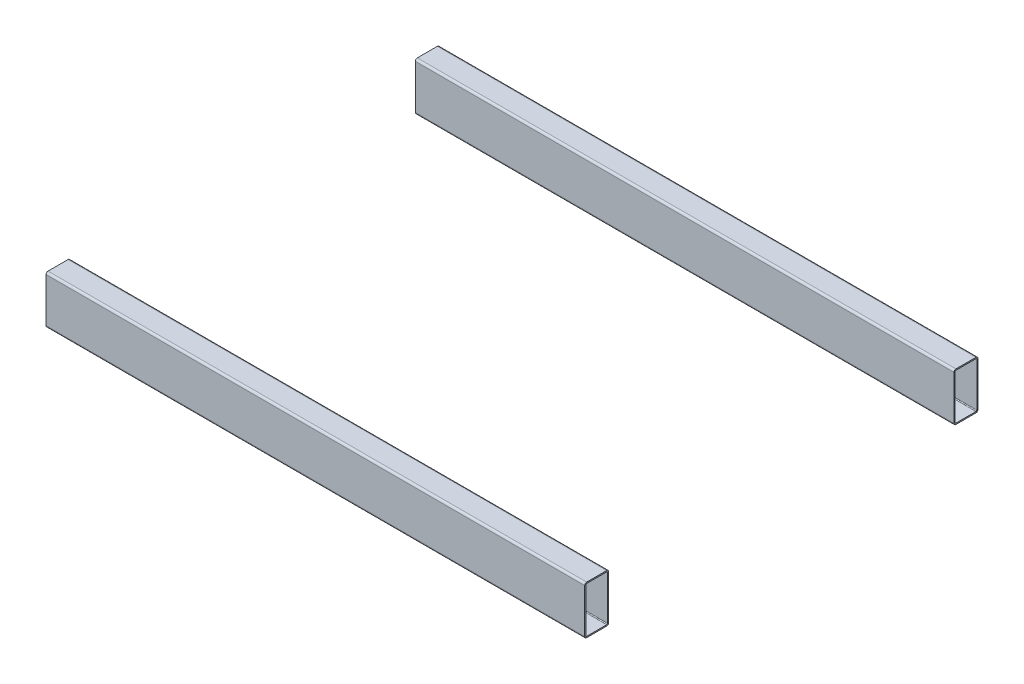
ISO-10303-21;
HEADER;
FILE_DESCRIPTION(('STEP AP214'),'2;1');
FILE_NAME('part.step','',(''),(''),'','','');
FILE_SCHEMA(('AUTOMOTIVE_DESIGN { 1 0 10303 214 1 1 1 1 }'));
ENDSEC;
DATA;
#1=APPLICATION_CONTEXT('core data for automotive mechanical design processes');
#2=APPLICATION_PROTOCOL_DEFINITION('international standard','automotive_design',2000,#1);
#3=PRODUCT_CONTEXT('',#1,'mechanical');
#4=PRODUCT('Part','Part','',(#3));
#5=PRODUCT_RELATED_PRODUCT_CATEGORY('part','',(#4));
#6=PRODUCT_DEFINITION_FORMATION('','',#4);
#7=PRODUCT_DEFINITION_CONTEXT('part definition',#1,'design');
#8=PRODUCT_DEFINITION('design','',#6,#7);
#9=PRODUCT_DEFINITION_SHAPE('','',#8);
#10=(LENGTH_UNIT() NAMED_UNIT(*) SI_UNIT(.MILLI.,.METRE.));
#11=(NAMED_UNIT(*) PLANE_ANGLE_UNIT() SI_UNIT($,.RADIAN.));
#12=(NAMED_UNIT(*) SI_UNIT($,.STERADIAN.) SOLID_ANGLE_UNIT());
#13=UNCERTAINTY_MEASURE_WITH_UNIT(LENGTH_MEASURE(1.E-05),#10,'distance_accuracy_value','');
#14=(GEOMETRIC_REPRESENTATION_CONTEXT(3) GLOBAL_UNCERTAINTY_ASSIGNED_CONTEXT((#13)) GLOBAL_UNIT_ASSIGNED_CONTEXT((#10,
#11,#12)) REPRESENTATION_CONTEXT('',''));
#15=CARTESIAN_POINT('',(0.,0.,0.));
#16=DIRECTION('',(0.,0.,1.));
#17=DIRECTION('',(1.,0.,0.));
#18=AXIS2_PLACEMENT_3D('',#15,#16,#17);
#19=CARTESIAN_POINT('',(-671.,-1294.,-919.999999999997));
#20=DIRECTION('',(0.,-1.,0.));
#21=DIRECTION('',(0.,0.,-1.));
#22=AXIS2_PLACEMENT_3D('',#19,#20,#21);
#23=PLANE('',#22);
#24=DIRECTION('',(0.,0.,1.));
#25=VECTOR('',#24,1.);
#26=CARTESIAN_POINT('',(-671.,-1294.,-919.999999999997));
#27=LINE('',#26,#25);
#28=CARTESIAN_POINT('',(-671.,-1294.,-914.999999999997));
#29=VERTEX_POINT('',#28);
#30=CARTESIAN_POINT('',(-671.,-1294.,-864.999999999997));
#31=VERTEX_POINT('',#30);
#32=EDGE_CURVE('E221',#29,#31,#27,.T.);
#33=ORIENTED_EDGE('',*,*,#32,.T.);
#34=DIRECTION('',(1.,0.,0.));
#35=VECTOR('',#34,1.);
#36=CARTESIAN_POINT('',(-671.,-1294.,-864.999999999997));
#37=LINE('',#36,#35);
#38=CARTESIAN_POINT('',(671.,-1294.,-864.999999999997));
#39=VERTEX_POINT('',#38);
#40=EDGE_CURVE('E270',#31,#39,#37,.T.);
#41=ORIENTED_EDGE('',*,*,#40,.T.);
#42=DIRECTION('',(0.,0.,1.));
#43=VECTOR('',#42,1.);
#44=CARTESIAN_POINT('',(671.,-1294.,-919.999999999997));
#45=LINE('',#44,#43);
#46=CARTESIAN_POINT('',(671.,-1294.,-914.999999999997));
#47=VERTEX_POINT('',#46);
#48=EDGE_CURVE('E234',#47,#39,#45,.T.);
#49=ORIENTED_EDGE('',*,*,#48,.F.);
#50=DIRECTION('',(1.,0.,0.));
#51=VECTOR('',#50,1.);
#52=CARTESIAN_POINT('',(-671.,-1294.,-914.999999999997));
#53=LINE('',#52,#51);
#54=EDGE_CURVE('E268',#47,#29,#53,.F.);
#55=ORIENTED_EDGE('',*,*,#54,.T.);
#56=EDGE_LOOP('',(#33,#41,#49,#55));
#57=FACE_BOUND('',#56,.T.);
#58=ADVANCED_FACE('F44',(#57),#23,.F.);
#59=CARTESIAN_POINT('',(671.,-1294.,-919.999999999997));
#60=DIRECTION('',(-1.,0.,0.));
#61=DIRECTION('',(0.,0.,1.));
#62=AXIS2_PLACEMENT_3D('',#59,#60,#61);
#63=PLANE('',#62);
#64=DIRECTION('',(0.,-1.,0.));
#65=VECTOR('',#64,1.);
#66=CARTESIAN_POINT('',(671.,-1299.,-916.999999999997));
#67=LINE('',#66,#65);
#68=CARTESIAN_POINT('',(671.,-1299.,-916.999999999997));
#69=VERTEX_POINT('',#68);
#70=CARTESIAN_POINT('',(671.,-1409.,-916.999999999997));
#71=VERTEX_POINT('',#70);
#72=EDGE_CURVE('E176',#69,#71,#67,.T.);
#73=ORIENTED_EDGE('',*,*,#72,.T.);
#74=CARTESIAN_POINT('',(671.,-1409.,-914.999999999997));
#75=DIRECTION('',(-1.,0.,0.));
#76=DIRECTION('',(0.,0.,1.));
#77=AXIS2_PLACEMENT_3D('',#74,#75,#76);
#78=CIRCLE('',#77,2.);
#79=CARTESIAN_POINT('',(671.,-1411.,-914.999999999997));
#80=VERTEX_POINT('',#79);
#81=EDGE_CURVE('E158',#71,#80,#78,.T.);
#82=ORIENTED_EDGE('',*,*,#81,.T.);
#83=DIRECTION('',(0.,0.,1.));
#84=VECTOR('',#83,1.);
#85=CARTESIAN_POINT('',(671.,-1411.,-914.999999999997));
#86=LINE('',#85,#84);
#87=CARTESIAN_POINT('',(671.,-1411.,-864.999999999997));
#88=VERTEX_POINT('',#87);
#89=EDGE_CURVE('E166',#80,#88,#86,.T.);
#90=ORIENTED_EDGE('',*,*,#89,.T.);
#91=CARTESIAN_POINT('',(671.,-1409.,-864.999999999997));
#92=DIRECTION('',(-1.,0.,0.));
#93=DIRECTION('',(0.,0.,1.));
#94=AXIS2_PLACEMENT_3D('',#91,#92,#93);
#95=CIRCLE('',#94,2.);
#96=CARTESIAN_POINT('',(671.,-1409.,-862.999999999997));
#97=VERTEX_POINT('',#96);
#98=EDGE_CURVE('E170',#88,#97,#95,.T.);
#99=ORIENTED_EDGE('',*,*,#98,.T.);
#100=DIRECTION('',(0.,1.,0.));
#101=VECTOR('',#100,1.);
#102=CARTESIAN_POINT('',(671.,-1409.,-862.999999999997));
#103=LINE('',#102,#101);
#104=CARTESIAN_POINT('',(671.,-1299.,-862.999999999997));
#105=VERTEX_POINT('',#104);
#106=EDGE_CURVE('E184',#97,#105,#103,.T.);
#107=ORIENTED_EDGE('',*,*,#106,.T.);
#108=CARTESIAN_POINT('',(671.,-1299.,-864.999999999997));
#109=DIRECTION('',(-1.,0.,0.));
#110=DIRECTION('',(0.,0.,1.));
#111=AXIS2_PLACEMENT_3D('',#108,#109,#110);
#112=CIRCLE('',#111,2.);
#113=CARTESIAN_POINT('',(671.,-1297.,-864.999999999997));
#114=VERTEX_POINT('',#113);
#115=EDGE_CURVE('E187',#105,#114,#112,.T.);
#116=ORIENTED_EDGE('',*,*,#115,.T.);
#117=DIRECTION('',(0.,0.,-1.));
#118=VECTOR('',#117,1.);
#119=CARTESIAN_POINT('',(671.,-1297.,-864.999999999997));
#120=LINE('',#119,#118);
#121=CARTESIAN_POINT('',(671.,-1297.,-914.999999999997));
#122=VERTEX_POINT('',#121);
#123=EDGE_CURVE('E190',#114,#122,#120,.T.);
#124=ORIENTED_EDGE('',*,*,#123,.T.);
#125=CARTESIAN_POINT('',(671.,-1299.,-914.999999999997));
#126=DIRECTION('',(-1.,0.,0.));
#127=DIRECTION('',(0.,0.,1.));
#128=AXIS2_PLACEMENT_3D('',#125,#126,#127);
#129=CIRCLE('',#128,2.);
#130=EDGE_CURVE('E193',#122,#69,#129,.T.);
#131=ORIENTED_EDGE('',*,*,#130,.T.);
#132=EDGE_LOOP('',(#73,#82,#90,#99,#107,#116,#124,#131));
#133=FACE_BOUND('',#132,.T.);
#134=DIRECTION('',(0.,-1.,0.));
#135=VECTOR('',#134,1.);
#136=CARTESIAN_POINT('',(671.,-1294.,-859.999999999997));
#137=LINE('',#136,#135);
#138=CARTESIAN_POINT('',(671.,-1299.,-859.999999999997));
#139=VERTEX_POINT('',#138);
#140=CARTESIAN_POINT('',(671.,-1409.,-859.999999999997));
#141=VERTEX_POINT('',#140);
#142=EDGE_CURVE('E196',#139,#141,#137,.T.);
#143=ORIENTED_EDGE('',*,*,#142,.T.);
#144=CARTESIAN_POINT('',(671.,-1409.,-864.999999999997));
#145=DIRECTION('',(-1.,0.,0.));
#146=DIRECTION('',(0.,0.,1.));
#147=AXIS2_PLACEMENT_3D('',#144,#145,#146);
#148=CIRCLE('',#147,5.);
#149=CARTESIAN_POINT('',(671.,-1414.,-864.999999999997));
#150=VERTEX_POINT('',#149);
#151=EDGE_CURVE('E260',#141,#150,#148,.F.);
#152=ORIENTED_EDGE('',*,*,#151,.T.);
#153=DIRECTION('',(0.,0.,1.));
#154=VECTOR('',#153,1.);
#155=CARTESIAN_POINT('',(671.,-1414.,-919.999999999997));
#156=LINE('',#155,#154);
#157=CARTESIAN_POINT('',(671.,-1414.,-914.999999999997));
#158=VERTEX_POINT('',#157);
#159=EDGE_CURVE('E231',#158,#150,#156,.T.);
#160=ORIENTED_EDGE('',*,*,#159,.F.);
#161=CARTESIAN_POINT('',(671.,-1409.,-914.999999999997));
#162=DIRECTION('',(-1.,0.,0.));
#163=DIRECTION('',(0.,0.,1.));
#164=AXIS2_PLACEMENT_3D('',#161,#162,#163);
#165=CIRCLE('',#164,5.);
#166=CARTESIAN_POINT('',(671.,-1409.,-919.999999999997));
#167=VERTEX_POINT('',#166);
#168=EDGE_CURVE('E258',#158,#167,#165,.F.);
#169=ORIENTED_EDGE('',*,*,#168,.T.);
#170=DIRECTION('',(0.,-1.,0.));
#171=VECTOR('',#170,1.);
#172=CARTESIAN_POINT('',(671.,-1294.,-919.999999999997));
#173=LINE('',#172,#171);
#174=CARTESIAN_POINT('',(671.,-1299.,-919.999999999997));
#175=VERTEX_POINT('',#174);
#176=EDGE_CURVE('E214',#175,#167,#173,.T.);
#177=ORIENTED_EDGE('',*,*,#176,.F.);
#178=CARTESIAN_POINT('',(671.,-1299.,-914.999999999997));
#179=DIRECTION('',(-1.,0.,0.));
#180=DIRECTION('',(0.,0.,1.));
#181=AXIS2_PLACEMENT_3D('',#178,#179,#180);
#182=CIRCLE('',#181,5.);
#183=EDGE_CURVE('E254',#175,#47,#182,.F.);
#184=ORIENTED_EDGE('',*,*,#183,.T.);
#185=ORIENTED_EDGE('',*,*,#48,.T.);
#186=CARTESIAN_POINT('',(671.,-1299.,-864.999999999997));
#187=DIRECTION('',(-1.,0.,0.));
#188=DIRECTION('',(0.,0.,1.));
#189=AXIS2_PLACEMENT_3D('',#186,#187,#188);
#190=CIRCLE('',#189,5.);
#191=EDGE_CURVE('E256',#39,#139,#190,.F.);
#192=ORIENTED_EDGE('',*,*,#191,.T.);
#193=EDGE_LOOP('',(#143,#152,#160,#169,#177,#184,#185,#192));
#194=FACE_BOUND('',#193,.T.);
#195=ADVANCED_FACE('F172',(#133,#194),#63,.F.);
#196=CARTESIAN_POINT('',(671.,-1414.,-919.999999999997));
#197=DIRECTION('',(0.,1.,0.));
#198=DIRECTION('',(0.,0.,1.));
#199=AXIS2_PLACEMENT_3D('',#196,#197,#198);
#200=PLANE('',#199);
#201=ORIENTED_EDGE('',*,*,#159,.T.);
#202=DIRECTION('',(-1.,0.,0.));
#203=VECTOR('',#202,1.);
#204=CARTESIAN_POINT('',(671.,-1414.,-864.999999999997));
#205=LINE('',#204,#203);
#206=CARTESIAN_POINT('',(-671.,-1414.,-864.999999999997));
#207=VERTEX_POINT('',#206);
#208=EDGE_CURVE('E239',#150,#207,#205,.T.);
#209=ORIENTED_EDGE('',*,*,#208,.T.);
#210=DIRECTION('',(0.,0.,1.));
#211=VECTOR('',#210,1.);
#212=CARTESIAN_POINT('',(-671.,-1414.,-919.999999999997));
#213=LINE('',#212,#211);
#214=CARTESIAN_POINT('',(-671.,-1414.,-914.999999999997));
#215=VERTEX_POINT('',#214);
#216=EDGE_CURVE('E228',#215,#207,#213,.T.);
#217=ORIENTED_EDGE('',*,*,#216,.F.);
#218=DIRECTION('',(-1.,0.,0.));
#219=VECTOR('',#218,1.);
#220=CARTESIAN_POINT('',(671.,-1414.,-914.999999999997));
#221=LINE('',#220,#219);
#222=EDGE_CURVE('E237',#215,#158,#221,.F.);
#223=ORIENTED_EDGE('',*,*,#222,.T.);
#224=EDGE_LOOP('',(#201,#209,#217,#223));
#225=FACE_BOUND('',#224,.T.);
#226=ADVANCED_FACE('F316',(#225),#200,.F.);
#227=CARTESIAN_POINT('',(-671.,-1414.,-919.999999999997));
#228=DIRECTION('',(1.,0.,0.));
#229=DIRECTION('',(0.,0.,-1.));
#230=AXIS2_PLACEMENT_3D('',#227,#228,#229);
#231=PLANE('',#230);
#232=DIRECTION('',(0.,0.,1.));
#233=VECTOR('',#232,1.);
#234=CARTESIAN_POINT('',(-671.,-1411.,-914.999999999997));
#235=LINE('',#234,#233);
#236=CARTESIAN_POINT('',(-671.,-1411.,-914.999999999997));
#237=VERTEX_POINT('',#236);
#238=CARTESIAN_POINT('',(-671.,-1411.,-864.999999999997));
#239=VERTEX_POINT('',#238);
#240=EDGE_CURVE('E198',#237,#239,#235,.T.);
#241=ORIENTED_EDGE('',*,*,#240,.F.);
#242=CARTESIAN_POINT('',(-671.,-1409.,-914.999999999997));
#243=DIRECTION('',(-1.,0.,0.));
#244=DIRECTION('',(0.,0.,1.));
#245=AXIS2_PLACEMENT_3D('',#242,#243,#244);
#246=CIRCLE('',#245,2.);
#247=CARTESIAN_POINT('',(-671.,-1409.,-916.999999999997));
#248=VERTEX_POINT('',#247);
#249=EDGE_CURVE('E161',#248,#237,#246,.T.);
#250=ORIENTED_EDGE('',*,*,#249,.F.);
#251=DIRECTION('',(0.,-1.,0.));
#252=VECTOR('',#251,1.);
#253=CARTESIAN_POINT('',(-671.,-1299.,-916.999999999997));
#254=LINE('',#253,#252);
#255=CARTESIAN_POINT('',(-671.,-1299.,-916.999999999997));
#256=VERTEX_POINT('',#255);
#257=EDGE_CURVE('E177',#256,#248,#254,.T.);
#258=ORIENTED_EDGE('',*,*,#257,.F.);
#259=CARTESIAN_POINT('',(-671.,-1299.,-914.999999999997));
#260=DIRECTION('',(-1.,0.,0.));
#261=DIRECTION('',(0.,0.,1.));
#262=AXIS2_PLACEMENT_3D('',#259,#260,#261);
#263=CIRCLE('',#262,2.);
#264=CARTESIAN_POINT('',(-671.,-1297.,-914.999999999997));
#265=VERTEX_POINT('',#264);
#266=EDGE_CURVE('E180',#265,#256,#263,.T.);
#267=ORIENTED_EDGE('',*,*,#266,.F.);
#268=DIRECTION('',(0.,0.,-1.));
#269=VECTOR('',#268,1.);
#270=CARTESIAN_POINT('',(-671.,-1297.,-864.999999999997));
#271=LINE('',#270,#269);
#272=CARTESIAN_POINT('',(-671.,-1297.,-864.999999999997));
#273=VERTEX_POINT('',#272);
#274=EDGE_CURVE('E209',#273,#265,#271,.T.);
#275=ORIENTED_EDGE('',*,*,#274,.F.);
#276=CARTESIAN_POINT('',(-671.,-1299.,-864.999999999997));
#277=DIRECTION('',(-1.,0.,0.));
#278=DIRECTION('',(0.,0.,1.));
#279=AXIS2_PLACEMENT_3D('',#276,#277,#278);
#280=CIRCLE('',#279,2.);
#281=CARTESIAN_POINT('',(-671.,-1299.,-862.999999999997));
#282=VERTEX_POINT('',#281);
#283=EDGE_CURVE('E206',#282,#273,#280,.T.);
#284=ORIENTED_EDGE('',*,*,#283,.F.);
#285=DIRECTION('',(0.,1.,0.));
#286=VECTOR('',#285,1.);
#287=CARTESIAN_POINT('',(-671.,-1409.,-862.999999999997));
#288=LINE('',#287,#286);
#289=CARTESIAN_POINT('',(-671.,-1409.,-862.999999999997));
#290=VERTEX_POINT('',#289);
#291=EDGE_CURVE('E203',#290,#282,#288,.T.);
#292=ORIENTED_EDGE('',*,*,#291,.F.);
#293=CARTESIAN_POINT('',(-671.,-1409.,-864.999999999997));
#294=DIRECTION('',(-1.,0.,0.));
#295=DIRECTION('',(0.,0.,1.));
#296=AXIS2_PLACEMENT_3D('',#293,#294,#295);
#297=CIRCLE('',#296,2.);
#298=EDGE_CURVE('E200',#239,#290,#297,.T.);
#299=ORIENTED_EDGE('',*,*,#298,.F.);
#300=EDGE_LOOP('',(#241,#250,#258,#267,#275,#284,#292,#299));
#301=FACE_BOUND('',#300,.T.);
#302=ORIENTED_EDGE('',*,*,#216,.T.);
#303=CARTESIAN_POINT('',(-671.,-1409.,-864.999999999997));
#304=DIRECTION('',(1.,0.,0.));
#305=DIRECTION('',(0.,0.,-1.));
#306=AXIS2_PLACEMENT_3D('',#303,#304,#305);
#307=CIRCLE('',#306,5.);
#308=CARTESIAN_POINT('',(-671.,-1409.,-859.999999999997));
#309=VERTEX_POINT('',#308);
#310=EDGE_CURVE('E248',#207,#309,#307,.F.);
#311=ORIENTED_EDGE('',*,*,#310,.T.);
#312=DIRECTION('',(0.,1.,0.));
#313=VECTOR('',#312,1.);
#314=CARTESIAN_POINT('',(-671.,-1414.,-859.999999999997));
#315=LINE('',#314,#313);
#316=CARTESIAN_POINT('',(-671.,-1299.,-859.999999999997));
#317=VERTEX_POINT('',#316);
#318=EDGE_CURVE('E218',#309,#317,#315,.T.);
#319=ORIENTED_EDGE('',*,*,#318,.T.);
#320=CARTESIAN_POINT('',(-671.,-1299.,-864.999999999997));
#321=DIRECTION('',(1.,0.,0.));
#322=DIRECTION('',(0.,0.,-1.));
#323=AXIS2_PLACEMENT_3D('',#320,#321,#322);
#324=CIRCLE('',#323,5.);
#325=EDGE_CURVE('E244',#317,#31,#324,.F.);
#326=ORIENTED_EDGE('',*,*,#325,.T.);
#327=ORIENTED_EDGE('',*,*,#32,.F.);
#328=CARTESIAN_POINT('',(-671.,-1299.,-914.999999999997));
#329=DIRECTION('',(1.,0.,0.));
#330=DIRECTION('',(0.,0.,-1.));
#331=AXIS2_PLACEMENT_3D('',#328,#329,#330);
#332=CIRCLE('',#331,5.);
#333=CARTESIAN_POINT('',(-671.,-1299.,-919.999999999997));
#334=VERTEX_POINT('',#333);
#335=EDGE_CURVE('E242',#29,#334,#332,.F.);
#336=ORIENTED_EDGE('',*,*,#335,.T.);
#337=DIRECTION('',(0.,1.,0.));
#338=VECTOR('',#337,1.);
#339=CARTESIAN_POINT('',(-671.,-1414.,-919.999999999997));
#340=LINE('',#339,#338);
#341=CARTESIAN_POINT('',(-671.,-1409.,-919.999999999997));
#342=VERTEX_POINT('',#341);
#343=EDGE_CURVE('E217',#342,#334,#340,.T.);
#344=ORIENTED_EDGE('',*,*,#343,.F.);
#345=CARTESIAN_POINT('',(-671.,-1409.,-914.999999999997));
#346=DIRECTION('',(1.,0.,0.));
#347=DIRECTION('',(0.,0.,-1.));
#348=AXIS2_PLACEMENT_3D('',#345,#346,#347);
#349=CIRCLE('',#348,5.);
#350=EDGE_CURVE('E246',#342,#215,#349,.F.);
#351=ORIENTED_EDGE('',*,*,#350,.T.);
#352=EDGE_LOOP('',(#302,#311,#319,#326,#327,#336,#344,#351));
#353=FACE_BOUND('',#352,.T.);
#354=ADVANCED_FACE('F294',(#301,#353),#231,.F.);
#355=CARTESIAN_POINT('',(0.,0.,-919.999999999997));
#356=DIRECTION('',(0.,0.,-1.));
#357=DIRECTION('',(-1.,0.,0.));
#358=AXIS2_PLACEMENT_3D('',#355,#356,#357);
#359=PLANE('',#358);
#360=ORIENTED_EDGE('',*,*,#176,.T.);
#361=DIRECTION('',(-1.,0.,0.));
#362=VECTOR('',#361,1.);
#363=CARTESIAN_POINT('',(-671.,-1409.,-919.999999999997));
#364=LINE('',#363,#362);
#365=EDGE_CURVE('E265',#167,#342,#364,.T.);
#366=ORIENTED_EDGE('',*,*,#365,.T.);
#367=ORIENTED_EDGE('',*,*,#343,.T.);
#368=DIRECTION('',(1.,0.,0.));
#369=VECTOR('',#368,1.);
#370=CARTESIAN_POINT('',(671.,-1299.,-919.999999999997));
#371=LINE('',#370,#369);
#372=EDGE_CURVE('E262',#334,#175,#371,.T.);
#373=ORIENTED_EDGE('',*,*,#372,.T.);
#374=EDGE_LOOP('',(#360,#366,#367,#373));
#375=FACE_BOUND('',#374,.T.);
#376=ADVANCED_FACE('F443',(#375),#359,.T.);
#377=CARTESIAN_POINT('',(0.,0.,-859.999999999997));
#378=DIRECTION('',(0.,0.,-1.));
#379=DIRECTION('',(-1.,0.,0.));
#380=AXIS2_PLACEMENT_3D('',#377,#378,#379);
#381=PLANE('',#380);
#382=ORIENTED_EDGE('',*,*,#318,.F.);
#383=DIRECTION('',(-1.,0.,0.));
#384=VECTOR('',#383,1.);
#385=CARTESIAN_POINT('',(0.,-1409.,-859.999999999997));
#386=LINE('',#385,#384);
#387=EDGE_CURVE('E252',#309,#141,#386,.F.);
#388=ORIENTED_EDGE('',*,*,#387,.T.);
#389=ORIENTED_EDGE('',*,*,#142,.F.);
#390=DIRECTION('',(1.,0.,0.));
#391=VECTOR('',#390,1.);
#392=CARTESIAN_POINT('',(0.,-1299.,-859.999999999997));
#393=LINE('',#392,#391);
#394=EDGE_CURVE('E250',#139,#317,#393,.F.);
#395=ORIENTED_EDGE('',*,*,#394,.T.);
#396=EDGE_LOOP('',(#382,#388,#389,#395));
#397=FACE_BOUND('',#396,.T.);
#398=ADVANCED_FACE('F324',(#397),#381,.F.);
#399=CARTESIAN_POINT('',(671.,-1409.,-864.999999999997));
#400=DIRECTION('',(-1.,0.,0.));
#401=DIRECTION('',(0.,0.,1.));
#402=AXIS2_PLACEMENT_3D('',#399,#400,#401);
#403=CYLINDRICAL_SURFACE('',#402,5.);
#404=ORIENTED_EDGE('',*,*,#151,.F.);
#405=ORIENTED_EDGE('',*,*,#387,.F.);
#406=ORIENTED_EDGE('',*,*,#310,.F.);
#407=ORIENTED_EDGE('',*,*,#208,.F.);
#408=EDGE_LOOP('',(#404,#405,#406,#407));
#409=FACE_BOUND('',#408,.T.);
#410=ADVANCED_FACE('F320',(#409),#403,.T.);
#411=CARTESIAN_POINT('',(0.,-1409.,-914.999999999997));
#412=DIRECTION('',(1.,0.,0.));
#413=DIRECTION('',(0.,0.,-1.));
#414=AXIS2_PLACEMENT_3D('',#411,#412,#413);
#415=CYLINDRICAL_SURFACE('',#414,5.);
#416=ORIENTED_EDGE('',*,*,#168,.F.);
#417=ORIENTED_EDGE('',*,*,#222,.F.);
#418=ORIENTED_EDGE('',*,*,#350,.F.);
#419=ORIENTED_EDGE('',*,*,#365,.F.);
#420=EDGE_LOOP('',(#416,#417,#418,#419));
#421=FACE_BOUND('',#420,.T.);
#422=ADVANCED_FACE('F323',(#421),#415,.T.);
#423=CARTESIAN_POINT('',(-671.,-1299.,-864.999999999997));
#424=DIRECTION('',(1.,0.,0.));
#425=DIRECTION('',(0.,0.,-1.));
#426=AXIS2_PLACEMENT_3D('',#423,#424,#425);
#427=CYLINDRICAL_SURFACE('',#426,5.);
#428=ORIENTED_EDGE('',*,*,#325,.F.);
#429=ORIENTED_EDGE('',*,*,#394,.F.);
#430=ORIENTED_EDGE('',*,*,#191,.F.);
#431=ORIENTED_EDGE('',*,*,#40,.F.);
#432=EDGE_LOOP('',(#428,#429,#430,#431));
#433=FACE_BOUND('',#432,.T.);
#434=ADVANCED_FACE('F328',(#433),#427,.T.);
#435=CARTESIAN_POINT('',(0.,-1299.,-914.999999999997));
#436=DIRECTION('',(-1.,0.,0.));
#437=DIRECTION('',(0.,0.,1.));
#438=AXIS2_PLACEMENT_3D('',#435,#436,#437);
#439=CYLINDRICAL_SURFACE('',#438,5.);
#440=ORIENTED_EDGE('',*,*,#335,.F.);
#441=ORIENTED_EDGE('',*,*,#54,.F.);
#442=ORIENTED_EDGE('',*,*,#183,.F.);
#443=ORIENTED_EDGE('',*,*,#372,.F.);
#444=EDGE_LOOP('',(#440,#441,#442,#443));
#445=FACE_BOUND('',#444,.T.);
#446=ADVANCED_FACE('F332',(#445),#439,.T.);
#447=CARTESIAN_POINT('',(-671.,-1297.,-919.999999999997));
#448=DIRECTION('',(0.,-1.,0.));
#449=DIRECTION('',(0.,0.,-1.));
#450=AXIS2_PLACEMENT_3D('',#447,#448,#449);
#451=PLANE('',#450);
#452=DIRECTION('',(1.,0.,0.));
#453=VECTOR('',#452,1.);
#454=CARTESIAN_POINT('',(-671.,-1297.,-864.999999999997));
#455=LINE('',#454,#453);
#456=EDGE_CURVE('E48',#273,#114,#455,.T.);
#457=ORIENTED_EDGE('',*,*,#456,.F.);
#458=ORIENTED_EDGE('',*,*,#274,.T.);
#459=DIRECTION('',(1.,0.,0.));
#460=VECTOR('',#459,1.);
#461=CARTESIAN_POINT('',(-671.,-1297.,-914.999999999997));
#462=LINE('',#461,#460);
#463=EDGE_CURVE('E277',#122,#265,#462,.F.);
#464=ORIENTED_EDGE('',*,*,#463,.F.);
#465=ORIENTED_EDGE('',*,*,#123,.F.);
#466=EDGE_LOOP('',(#457,#458,#464,#465));
#467=FACE_BOUND('',#466,.T.);
#468=ADVANCED_FACE('F287',(#467),#451,.T.);
#469=CARTESIAN_POINT('',(671.,-1411.,-919.999999999997));
#470=DIRECTION('',(0.,1.,0.));
#471=DIRECTION('',(0.,0.,1.));
#472=AXIS2_PLACEMENT_3D('',#469,#470,#471);
#473=PLANE('',#472);
#474=DIRECTION('',(1.,0.,0.));
#475=VECTOR('',#474,1.);
#476=CARTESIAN_POINT('',(671.,-1411.,-864.999999999997));
#477=LINE('',#476,#475);
#478=EDGE_CURVE('E61',#88,#239,#477,.F.);
#479=ORIENTED_EDGE('',*,*,#478,.F.);
#480=ORIENTED_EDGE('',*,*,#89,.F.);
#481=DIRECTION('',(1.,0.,0.));
#482=VECTOR('',#481,1.);
#483=CARTESIAN_POINT('',(671.,-1411.,-914.999999999997));
#484=LINE('',#483,#482);
#485=EDGE_CURVE('E66',#237,#80,#484,.T.);
#486=ORIENTED_EDGE('',*,*,#485,.F.);
#487=ORIENTED_EDGE('',*,*,#240,.T.);
#488=EDGE_LOOP('',(#479,#480,#486,#487));
#489=FACE_BOUND('',#488,.T.);
#490=ADVANCED_FACE('F167',(#489),#473,.T.);
#491=CARTESIAN_POINT('',(0.,0.,-916.999999999997));
#492=DIRECTION('',(0.,0.,-1.));
#493=DIRECTION('',(-1.,0.,0.));
#494=AXIS2_PLACEMENT_3D('',#491,#492,#493);
#495=PLANE('',#494);
#496=DIRECTION('',(-1.,0.,0.));
#497=VECTOR('',#496,1.);
#498=CARTESIAN_POINT('',(0.,-1409.,-916.999999999997));
#499=LINE('',#498,#497);
#500=EDGE_CURVE('E163',#71,#248,#499,.T.);
#501=ORIENTED_EDGE('',*,*,#500,.F.);
#502=ORIENTED_EDGE('',*,*,#72,.F.);
#503=DIRECTION('',(-1.,0.,0.));
#504=VECTOR('',#503,1.);
#505=CARTESIAN_POINT('',(0.,-1299.,-916.999999999997));
#506=LINE('',#505,#504);
#507=EDGE_CURVE('E274',#256,#69,#506,.F.);
#508=ORIENTED_EDGE('',*,*,#507,.F.);
#509=ORIENTED_EDGE('',*,*,#257,.T.);
#510=EDGE_LOOP('',(#501,#502,#508,#509));
#511=FACE_BOUND('',#510,.T.);
#512=ADVANCED_FACE('F299',(#511),#495,.F.);
#513=CARTESIAN_POINT('',(0.,0.,-862.999999999997));
#514=DIRECTION('',(0.,0.,-1.));
#515=DIRECTION('',(-1.,0.,0.));
#516=AXIS2_PLACEMENT_3D('',#513,#514,#515);
#517=PLANE('',#516);
#518=DIRECTION('',(-1.,0.,0.));
#519=VECTOR('',#518,1.);
#520=CARTESIAN_POINT('',(0.,-1409.,-862.999999999997));
#521=LINE('',#520,#519);
#522=EDGE_CURVE('E53',#290,#97,#521,.F.);
#523=ORIENTED_EDGE('',*,*,#522,.F.);
#524=ORIENTED_EDGE('',*,*,#291,.T.);
#525=DIRECTION('',(-1.,0.,0.));
#526=VECTOR('',#525,1.);
#527=CARTESIAN_POINT('',(0.,-1299.,-862.999999999997));
#528=LINE('',#527,#526);
#529=EDGE_CURVE('E12',#105,#282,#528,.T.);
#530=ORIENTED_EDGE('',*,*,#529,.F.);
#531=ORIENTED_EDGE('',*,*,#106,.F.);
#532=EDGE_LOOP('',(#523,#524,#530,#531));
#533=FACE_BOUND('',#532,.T.);
#534=ADVANCED_FACE('F290',(#533),#517,.T.);
#535=CARTESIAN_POINT('',(671.,-1409.,-864.999999999997));
#536=DIRECTION('',(-1.,0.,0.));
#537=DIRECTION('',(0.,0.,1.));
#538=AXIS2_PLACEMENT_3D('',#535,#536,#537);
#539=CYLINDRICAL_SURFACE('',#538,2.);
#540=ORIENTED_EDGE('',*,*,#522,.T.);
#541=ORIENTED_EDGE('',*,*,#98,.F.);
#542=ORIENTED_EDGE('',*,*,#478,.T.);
#543=ORIENTED_EDGE('',*,*,#298,.T.);
#544=EDGE_LOOP('',(#540,#541,#542,#543));
#545=FACE_BOUND('',#544,.T.);
#546=ADVANCED_FACE('F301',(#545),#539,.F.);
#547=CARTESIAN_POINT('',(0.,-1409.,-914.999999999997));
#548=DIRECTION('',(1.,0.,0.));
#549=DIRECTION('',(0.,0.,-1.));
#550=AXIS2_PLACEMENT_3D('',#547,#548,#549);
#551=CYLINDRICAL_SURFACE('',#550,2.);
#552=ORIENTED_EDGE('',*,*,#485,.T.);
#553=ORIENTED_EDGE('',*,*,#81,.F.);
#554=ORIENTED_EDGE('',*,*,#500,.T.);
#555=ORIENTED_EDGE('',*,*,#249,.T.);
#556=EDGE_LOOP('',(#552,#553,#554,#555));
#557=FACE_BOUND('',#556,.T.);
#558=ADVANCED_FACE('F156',(#557),#551,.F.);
#559=CARTESIAN_POINT('',(-671.,-1299.,-864.999999999997));
#560=DIRECTION('',(1.,0.,0.));
#561=DIRECTION('',(0.,0.,-1.));
#562=AXIS2_PLACEMENT_3D('',#559,#560,#561);
#563=CYLINDRICAL_SURFACE('',#562,2.);
#564=ORIENTED_EDGE('',*,*,#529,.T.);
#565=ORIENTED_EDGE('',*,*,#283,.T.);
#566=ORIENTED_EDGE('',*,*,#456,.T.);
#567=ORIENTED_EDGE('',*,*,#115,.F.);
#568=EDGE_LOOP('',(#564,#565,#566,#567));
#569=FACE_BOUND('',#568,.T.);
#570=ADVANCED_FACE('F283',(#569),#563,.F.);
#571=CARTESIAN_POINT('',(0.,-1299.,-914.999999999997));
#572=DIRECTION('',(-1.,0.,0.));
#573=DIRECTION('',(0.,0.,1.));
#574=AXIS2_PLACEMENT_3D('',#571,#572,#573);
#575=CYLINDRICAL_SURFACE('',#574,2.);
#576=ORIENTED_EDGE('',*,*,#463,.T.);
#577=ORIENTED_EDGE('',*,*,#266,.T.);
#578=ORIENTED_EDGE('',*,*,#507,.T.);
#579=ORIENTED_EDGE('',*,*,#130,.F.);
#580=EDGE_LOOP('',(#576,#577,#578,#579));
#581=FACE_BOUND('',#580,.T.);
#582=ADVANCED_FACE('F46',(#581),#575,.F.);
#583=CLOSED_SHELL('',(#58,#195,#226,#354,#376,#398,#410,#422,#434,#446,#468,#490,#512,#534,#546,
#558,#570,#582));
#584=MANIFOLD_SOLID_BREP('B2',#583);
#585=CARTESIAN_POINT('',(671.,-1294.,60.));
#586=DIRECTION('',(-1.,0.,0.));
#587=DIRECTION('',(0.,0.,1.));
#588=AXIS2_PLACEMENT_3D('',#585,#586,#587);
#589=PLANE('',#588);
#590=DIRECTION('',(0.,-1.,0.));
#591=VECTOR('',#590,1.);
#592=CARTESIAN_POINT('',(671.,-1299.,3.));
#593=LINE('',#592,#591);
#594=CARTESIAN_POINT('',(671.,-1299.,3.));
#595=VERTEX_POINT('',#594);
#596=CARTESIAN_POINT('',(671.,-1409.,3.));
#597=VERTEX_POINT('',#596);
#598=EDGE_CURVE('E636',#595,#597,#593,.T.);
#599=ORIENTED_EDGE('',*,*,#598,.T.);
#600=CARTESIAN_POINT('',(671.,-1409.,5.));
#601=DIRECTION('',(-1.,0.,0.));
#602=DIRECTION('',(0.,0.,1.));
#603=AXIS2_PLACEMENT_3D('',#600,#601,#602);
#604=CIRCLE('',#603,2.);
#605=CARTESIAN_POINT('',(671.,-1411.,5.));
#606=VERTEX_POINT('',#605);
#607=EDGE_CURVE('E619',#597,#606,#604,.T.);
#608=ORIENTED_EDGE('',*,*,#607,.T.);
#609=DIRECTION('',(0.,0.,1.));
#610=VECTOR('',#609,1.);
#611=CARTESIAN_POINT('',(671.,-1411.,5.));
#612=LINE('',#611,#610);
#613=CARTESIAN_POINT('',(671.,-1411.,55.));
#614=VERTEX_POINT('',#613);
#615=EDGE_CURVE('E627',#606,#614,#612,.T.);
#616=ORIENTED_EDGE('',*,*,#615,.T.);
#617=CARTESIAN_POINT('',(671.,-1409.,55.));
#618=DIRECTION('',(-1.,0.,0.));
#619=DIRECTION('',(0.,0.,1.));
#620=AXIS2_PLACEMENT_3D('',#617,#618,#619);
#621=CIRCLE('',#620,1.99999999999997);
#622=CARTESIAN_POINT('',(671.,-1409.,57.));
#623=VERTEX_POINT('',#622);
#624=EDGE_CURVE('E631',#614,#623,#621,.T.);
#625=ORIENTED_EDGE('',*,*,#624,.T.);
#626=DIRECTION('',(0.,1.,0.));
#627=VECTOR('',#626,1.);
#628=CARTESIAN_POINT('',(671.,-1409.,56.9999999999999));
#629=LINE('',#628,#627);
#630=CARTESIAN_POINT('',(671.,-1299.,57.));
#631=VERTEX_POINT('',#630);
#632=EDGE_CURVE('E644',#623,#631,#629,.T.);
#633=ORIENTED_EDGE('',*,*,#632,.T.);
#634=CARTESIAN_POINT('',(671.,-1299.,55.));
#635=DIRECTION('',(-1.,0.,0.));
#636=DIRECTION('',(0.,0.,1.));
#637=AXIS2_PLACEMENT_3D('',#634,#635,#636);
#638=CIRCLE('',#637,2.);
#639=CARTESIAN_POINT('',(671.,-1297.,55.));
#640=VERTEX_POINT('',#639);
#641=EDGE_CURVE('E647',#631,#640,#638,.T.);
#642=ORIENTED_EDGE('',*,*,#641,.T.);
#643=DIRECTION('',(0.,0.,-1.));
#644=VECTOR('',#643,1.);
#645=CARTESIAN_POINT('',(671.,-1297.,55.));
#646=LINE('',#645,#644);
#647=CARTESIAN_POINT('',(671.,-1297.,5.));
#648=VERTEX_POINT('',#647);
#649=EDGE_CURVE('E650',#640,#648,#646,.T.);
#650=ORIENTED_EDGE('',*,*,#649,.T.);
#651=CARTESIAN_POINT('',(671.,-1299.,5.));
#652=DIRECTION('',(-1.,0.,0.));
#653=DIRECTION('',(0.,0.,1.));
#654=AXIS2_PLACEMENT_3D('',#651,#652,#653);
#655=CIRCLE('',#654,2.);
#656=EDGE_CURVE('E653',#648,#595,#655,.T.);
#657=ORIENTED_EDGE('',*,*,#656,.T.);
#658=EDGE_LOOP('',(#599,#608,#616,#625,#633,#642,#650,#657));
#659=FACE_BOUND('',#658,.T.);
#660=DIRECTION('',(0.,0.,-1.));
#661=VECTOR('',#660,1.);
#662=CARTESIAN_POINT('',(671.,-1414.,60.));
#663=LINE('',#662,#661);
#664=CARTESIAN_POINT('',(671.,-1414.,55.));
#665=VERTEX_POINT('',#664);
#666=CARTESIAN_POINT('',(671.,-1414.,5.));
#667=VERTEX_POINT('',#666);
#668=EDGE_CURVE('E681',#665,#667,#663,.T.);
#669=ORIENTED_EDGE('',*,*,#668,.T.);
#670=CARTESIAN_POINT('',(671.,-1409.,5.));
#671=DIRECTION('',(-1.,0.,0.));
#672=DIRECTION('',(0.,0.,1.));
#673=AXIS2_PLACEMENT_3D('',#670,#671,#672);
#674=CIRCLE('',#673,5.);
#675=CARTESIAN_POINT('',(671.,-1409.,0.));
#676=VERTEX_POINT('',#675);
#677=EDGE_CURVE('E708',#667,#676,#674,.F.);
#678=ORIENTED_EDGE('',*,*,#677,.T.);
#679=DIRECTION('',(0.,1.,0.));
#680=VECTOR('',#679,1.);
#681=CARTESIAN_POINT('',(671.,-1294.,0.));
#682=LINE('',#681,#680);
#683=CARTESIAN_POINT('',(671.,-1299.,0.));
#684=VERTEX_POINT('',#683);
#685=EDGE_CURVE('E656',#676,#684,#682,.T.);
#686=ORIENTED_EDGE('',*,*,#685,.T.);
#687=CARTESIAN_POINT('',(671.,-1299.,5.));
#688=DIRECTION('',(-1.,0.,0.));
#689=DIRECTION('',(0.,0.,1.));
#690=AXIS2_PLACEMENT_3D('',#687,#688,#689);
#691=CIRCLE('',#690,5.);
#692=CARTESIAN_POINT('',(671.,-1294.,5.));
#693=VERTEX_POINT('',#692);
#694=EDGE_CURVE('E706',#684,#693,#691,.F.);
#695=ORIENTED_EDGE('',*,*,#694,.T.);
#696=DIRECTION('',(0.,0.,-1.));
#697=VECTOR('',#696,1.);
#698=CARTESIAN_POINT('',(671.,-1294.,60.));
#699=LINE('',#698,#697);
#700=CARTESIAN_POINT('',(671.,-1294.,55.));
#701=VERTEX_POINT('',#700);
#702=EDGE_CURVE('E694',#701,#693,#699,.T.);
#703=ORIENTED_EDGE('',*,*,#702,.F.);
#704=CARTESIAN_POINT('',(671.,-1299.,55.));
#705=DIRECTION('',(-1.,0.,0.));
#706=DIRECTION('',(0.,0.,1.));
#707=AXIS2_PLACEMENT_3D('',#704,#705,#706);
#708=CIRCLE('',#707,5.);
#709=CARTESIAN_POINT('',(671.,-1299.,60.));
#710=VERTEX_POINT('',#709);
#711=EDGE_CURVE('E704',#701,#710,#708,.F.);
#712=ORIENTED_EDGE('',*,*,#711,.T.);
#713=DIRECTION('',(0.,1.,0.));
#714=VECTOR('',#713,1.);
#715=CARTESIAN_POINT('',(671.,-1294.,60.));
#716=LINE('',#715,#714);
#717=CARTESIAN_POINT('',(671.,-1409.,60.));
#718=VERTEX_POINT('',#717);
#719=EDGE_CURVE('E674',#718,#710,#716,.T.);
#720=ORIENTED_EDGE('',*,*,#719,.F.);
#721=CARTESIAN_POINT('',(671.,-1409.,55.));
#722=DIRECTION('',(-1.,0.,0.));
#723=DIRECTION('',(0.,0.,1.));
#724=AXIS2_PLACEMENT_3D('',#721,#722,#723);
#725=CIRCLE('',#724,5.);
#726=EDGE_CURVE('E702',#718,#665,#725,.F.);
#727=ORIENTED_EDGE('',*,*,#726,.T.);
#728=EDGE_LOOP('',(#669,#678,#686,#695,#703,#712,#720,#727));
#729=FACE_BOUND('',#728,.T.);
#730=ADVANCED_FACE('F505',(#659,#729),#589,.F.);
#731=CARTESIAN_POINT('',(-671.,-1294.,60.));
#732=DIRECTION('',(0.,-1.,0.));
#733=DIRECTION('',(0.,0.,-1.));
#734=AXIS2_PLACEMENT_3D('',#731,#732,#733);
#735=PLANE('',#734);
#736=ORIENTED_EDGE('',*,*,#702,.T.);
#737=DIRECTION('',(-1.,0.,0.));
#738=VECTOR('',#737,1.);
#739=CARTESIAN_POINT('',(-671.,-1294.,5.));
#740=LINE('',#739,#738);
#741=CARTESIAN_POINT('',(-671.,-1294.,5.));
#742=VERTEX_POINT('',#741);
#743=EDGE_CURVE('E724',#693,#742,#740,.T.);
#744=ORIENTED_EDGE('',*,*,#743,.T.);
#745=DIRECTION('',(0.,0.,-1.));
#746=VECTOR('',#745,1.);
#747=CARTESIAN_POINT('',(-671.,-1294.,60.));
#748=LINE('',#747,#746);
#749=CARTESIAN_POINT('',(-671.,-1294.,55.));
#750=VERTEX_POINT('',#749);
#751=EDGE_CURVE('E691',#750,#742,#748,.T.);
#752=ORIENTED_EDGE('',*,*,#751,.F.);
#753=DIRECTION('',(-1.,0.,0.));
#754=VECTOR('',#753,1.);
#755=CARTESIAN_POINT('',(671.,-1294.,55.));
#756=LINE('',#755,#754);
#757=EDGE_CURVE('E722',#750,#701,#756,.F.);
#758=ORIENTED_EDGE('',*,*,#757,.T.);
#759=EDGE_LOOP('',(#736,#744,#752,#758));
#760=FACE_BOUND('',#759,.T.);
#761=ADVANCED_FACE('F767',(#760),#735,.F.);
#762=CARTESIAN_POINT('',(-671.,-1294.,60.));
#763=DIRECTION('',(1.,0.,0.));
#764=DIRECTION('',(0.,0.,-1.));
#765=AXIS2_PLACEMENT_3D('',#762,#763,#764);
#766=PLANE('',#765);
#767=DIRECTION('',(0.,0.,1.));
#768=VECTOR('',#767,1.);
#769=CARTESIAN_POINT('',(-671.,-1411.,5.));
#770=LINE('',#769,#768);
#771=CARTESIAN_POINT('',(-671.,-1411.,5.));
#772=VERTEX_POINT('',#771);
#773=CARTESIAN_POINT('',(-671.,-1411.,55.));
#774=VERTEX_POINT('',#773);
#775=EDGE_CURVE('E658',#772,#774,#770,.T.);
#776=ORIENTED_EDGE('',*,*,#775,.F.);
#777=CARTESIAN_POINT('',(-671.,-1409.,5.));
#778=DIRECTION('',(-1.,0.,0.));
#779=DIRECTION('',(0.,0.,1.));
#780=AXIS2_PLACEMENT_3D('',#777,#778,#779);
#781=CIRCLE('',#780,2.);
#782=CARTESIAN_POINT('',(-671.,-1409.,3.));
#783=VERTEX_POINT('',#782);
#784=EDGE_CURVE('E622',#783,#772,#781,.T.);
#785=ORIENTED_EDGE('',*,*,#784,.F.);
#786=DIRECTION('',(0.,-1.,0.));
#787=VECTOR('',#786,1.);
#788=CARTESIAN_POINT('',(-671.,-1299.,3.));
#789=LINE('',#788,#787);
#790=CARTESIAN_POINT('',(-671.,-1299.,3.));
#791=VERTEX_POINT('',#790);
#792=EDGE_CURVE('E637',#791,#783,#789,.T.);
#793=ORIENTED_EDGE('',*,*,#792,.F.);
#794=CARTESIAN_POINT('',(-671.,-1299.,5.));
#795=DIRECTION('',(-1.,0.,0.));
#796=DIRECTION('',(0.,0.,1.));
#797=AXIS2_PLACEMENT_3D('',#794,#795,#796);
#798=CIRCLE('',#797,2.);
#799=CARTESIAN_POINT('',(-671.,-1297.,5.));
#800=VERTEX_POINT('',#799);
#801=EDGE_CURVE('E640',#800,#791,#798,.T.);
#802=ORIENTED_EDGE('',*,*,#801,.F.);
#803=DIRECTION('',(0.,0.,-1.));
#804=VECTOR('',#803,1.);
#805=CARTESIAN_POINT('',(-671.,-1297.,55.));
#806=LINE('',#805,#804);
#807=CARTESIAN_POINT('',(-671.,-1297.,55.));
#808=VERTEX_POINT('',#807);
#809=EDGE_CURVE('E669',#808,#800,#806,.T.);
#810=ORIENTED_EDGE('',*,*,#809,.F.);
#811=CARTESIAN_POINT('',(-671.,-1299.,55.));
#812=DIRECTION('',(-1.,0.,0.));
#813=DIRECTION('',(0.,0.,1.));
#814=AXIS2_PLACEMENT_3D('',#811,#812,#813);
#815=CIRCLE('',#814,2.);
#816=CARTESIAN_POINT('',(-671.,-1299.,57.));
#817=VERTEX_POINT('',#816);
#818=EDGE_CURVE('E666',#817,#808,#815,.T.);
#819=ORIENTED_EDGE('',*,*,#818,.F.);
#820=DIRECTION('',(0.,1.,0.));
#821=VECTOR('',#820,1.);
#822=CARTESIAN_POINT('',(-671.,-1409.,56.9999999999999));
#823=LINE('',#822,#821);
#824=CARTESIAN_POINT('',(-671.,-1409.,57.));
#825=VERTEX_POINT('',#824);
#826=EDGE_CURVE('E663',#825,#817,#823,.T.);
#827=ORIENTED_EDGE('',*,*,#826,.F.);
#828=CARTESIAN_POINT('',(-671.,-1409.,55.));
#829=DIRECTION('',(-1.,0.,0.));
#830=DIRECTION('',(0.,0.,1.));
#831=AXIS2_PLACEMENT_3D('',#828,#829,#830);
#832=CIRCLE('',#831,1.99999999999997);
#833=EDGE_CURVE('E660',#774,#825,#832,.T.);
#834=ORIENTED_EDGE('',*,*,#833,.F.);
#835=EDGE_LOOP('',(#776,#785,#793,#802,#810,#819,#827,#834));
#836=FACE_BOUND('',#835,.T.);
#837=DIRECTION('',(0.,-1.,0.));
#838=VECTOR('',#837,1.);
#839=CARTESIAN_POINT('',(-671.,-1294.,0.));
#840=LINE('',#839,#838);
#841=CARTESIAN_POINT('',(-671.,-1299.,0.));
#842=VERTEX_POINT('',#841);
#843=CARTESIAN_POINT('',(-671.,-1409.,0.));
#844=VERTEX_POINT('',#843);
#845=EDGE_CURVE('E678',#842,#844,#840,.T.);
#846=ORIENTED_EDGE('',*,*,#845,.T.);
#847=CARTESIAN_POINT('',(-671.,-1409.,5.));
#848=DIRECTION('',(1.,0.,0.));
#849=DIRECTION('',(0.,0.,-1.));
#850=AXIS2_PLACEMENT_3D('',#847,#848,#849);
#851=CIRCLE('',#850,5.);
#852=CARTESIAN_POINT('',(-671.,-1414.,5.));
#853=VERTEX_POINT('',#852);
#854=EDGE_CURVE('E720',#844,#853,#851,.F.);
#855=ORIENTED_EDGE('',*,*,#854,.T.);
#856=DIRECTION('',(0.,0.,-1.));
#857=VECTOR('',#856,1.);
#858=CARTESIAN_POINT('',(-671.,-1414.,60.));
#859=LINE('',#858,#857);
#860=CARTESIAN_POINT('',(-671.,-1414.,55.));
#861=VERTEX_POINT('',#860);
#862=EDGE_CURVE('E688',#861,#853,#859,.T.);
#863=ORIENTED_EDGE('',*,*,#862,.F.);
#864=CARTESIAN_POINT('',(-671.,-1409.,55.));
#865=DIRECTION('',(1.,0.,0.));
#866=DIRECTION('',(0.,0.,-1.));
#867=AXIS2_PLACEMENT_3D('',#864,#865,#866);
#868=CIRCLE('',#867,5.);
#869=CARTESIAN_POINT('',(-671.,-1409.,60.));
#870=VERTEX_POINT('',#869);
#871=EDGE_CURVE('E714',#861,#870,#868,.F.);
#872=ORIENTED_EDGE('',*,*,#871,.T.);
#873=DIRECTION('',(0.,-1.,0.));
#874=VECTOR('',#873,1.);
#875=CARTESIAN_POINT('',(-671.,-1294.,60.));
#876=LINE('',#875,#874);
#877=CARTESIAN_POINT('',(-671.,-1299.,60.));
#878=VERTEX_POINT('',#877);
#879=EDGE_CURVE('E677',#878,#870,#876,.T.);
#880=ORIENTED_EDGE('',*,*,#879,.F.);
#881=CARTESIAN_POINT('',(-671.,-1299.,55.));
#882=DIRECTION('',(1.,0.,0.));
#883=DIRECTION('',(0.,0.,-1.));
#884=AXIS2_PLACEMENT_3D('',#881,#882,#883);
#885=CIRCLE('',#884,5.);
#886=EDGE_CURVE('E716',#878,#750,#885,.F.);
#887=ORIENTED_EDGE('',*,*,#886,.T.);
#888=ORIENTED_EDGE('',*,*,#751,.T.);
#889=CARTESIAN_POINT('',(-671.,-1299.,5.));
#890=DIRECTION('',(1.,0.,0.));
#891=DIRECTION('',(0.,0.,-1.));
#892=AXIS2_PLACEMENT_3D('',#889,#890,#891);
#893=CIRCLE('',#892,5.);
#894=EDGE_CURVE('E718',#742,#842,#893,.F.);
#895=ORIENTED_EDGE('',*,*,#894,.T.);
#896=EDGE_LOOP('',(#846,#855,#863,#872,#880,#887,#888,#895));
#897=FACE_BOUND('',#896,.T.);
#898=ADVANCED_FACE('F751',(#836,#897),#766,.F.);
#899=CARTESIAN_POINT('',(-671.,-1414.,60.));
#900=DIRECTION('',(0.,1.,0.));
#901=DIRECTION('',(0.,0.,1.));
#902=AXIS2_PLACEMENT_3D('',#899,#900,#901);
#903=PLANE('',#902);
#904=ORIENTED_EDGE('',*,*,#862,.T.);
#905=DIRECTION('',(1.,0.,0.));
#906=VECTOR('',#905,1.);
#907=CARTESIAN_POINT('',(-671.,-1414.,5.));
#908=LINE('',#907,#906);
#909=EDGE_CURVE('E699',#853,#667,#908,.T.);
#910=ORIENTED_EDGE('',*,*,#909,.T.);
#911=ORIENTED_EDGE('',*,*,#668,.F.);
#912=DIRECTION('',(1.,0.,0.));
#913=VECTOR('',#912,1.);
#914=CARTESIAN_POINT('',(-671.,-1414.,55.));
#915=LINE('',#914,#913);
#916=EDGE_CURVE('E697',#665,#861,#915,.F.);
#917=ORIENTED_EDGE('',*,*,#916,.T.);
#918=EDGE_LOOP('',(#904,#910,#911,#917));
#919=FACE_BOUND('',#918,.T.);
#920=ADVANCED_FACE('F902',(#919),#903,.F.);
#921=CARTESIAN_POINT('',(0.,0.,60.));
#922=DIRECTION('',(0.,0.,1.));
#923=DIRECTION('',(1.,0.,0.));
#924=AXIS2_PLACEMENT_3D('',#921,#922,#923);
#925=PLANE('',#924);
#926=ORIENTED_EDGE('',*,*,#719,.T.);
#927=DIRECTION('',(-1.,0.,0.));
#928=VECTOR('',#927,1.);
#929=CARTESIAN_POINT('',(-671.,-1299.,60.));
#930=LINE('',#929,#928);
#931=EDGE_CURVE('E730',#710,#878,#930,.T.);
#932=ORIENTED_EDGE('',*,*,#931,.T.);
#933=ORIENTED_EDGE('',*,*,#879,.T.);
#934=DIRECTION('',(1.,0.,0.));
#935=VECTOR('',#934,1.);
#936=CARTESIAN_POINT('',(671.,-1409.,60.));
#937=LINE('',#936,#935);
#938=EDGE_CURVE('E727',#870,#718,#937,.T.);
#939=ORIENTED_EDGE('',*,*,#938,.T.);
#940=EDGE_LOOP('',(#926,#932,#933,#939));
#941=FACE_BOUND('',#940,.T.);
#942=ADVANCED_FACE('F894',(#941),#925,.T.);
#943=CARTESIAN_POINT('',(0.,0.,0.));
#944=DIRECTION('',(0.,0.,1.));
#945=DIRECTION('',(1.,0.,0.));
#946=AXIS2_PLACEMENT_3D('',#943,#944,#945);
#947=PLANE('',#946);
#948=ORIENTED_EDGE('',*,*,#685,.F.);
#949=DIRECTION('',(1.,0.,0.));
#950=VECTOR('',#949,1.);
#951=CARTESIAN_POINT('',(0.,-1409.,0.));
#952=LINE('',#951,#950);
#953=EDGE_CURVE('E712',#676,#844,#952,.F.);
#954=ORIENTED_EDGE('',*,*,#953,.T.);
#955=ORIENTED_EDGE('',*,*,#845,.F.);
#956=DIRECTION('',(-1.,0.,0.));
#957=VECTOR('',#956,1.);
#958=CARTESIAN_POINT('',(0.,-1299.,0.));
#959=LINE('',#958,#957);
#960=EDGE_CURVE('E710',#842,#684,#959,.F.);
#961=ORIENTED_EDGE('',*,*,#960,.T.);
#962=EDGE_LOOP('',(#948,#954,#955,#961));
#963=FACE_BOUND('',#962,.T.);
#964=ADVANCED_FACE('F780',(#963),#947,.F.);
#965=CARTESIAN_POINT('',(-671.,-1409.,5.));
#966=DIRECTION('',(1.,0.,0.));
#967=DIRECTION('',(0.,0.,-1.));
#968=AXIS2_PLACEMENT_3D('',#965,#966,#967);
#969=CYLINDRICAL_SURFACE('',#968,5.);
#970=ORIENTED_EDGE('',*,*,#854,.F.);
#971=ORIENTED_EDGE('',*,*,#953,.F.);
#972=ORIENTED_EDGE('',*,*,#677,.F.);
#973=ORIENTED_EDGE('',*,*,#909,.F.);
#974=EDGE_LOOP('',(#970,#971,#972,#973));
#975=FACE_BOUND('',#974,.T.);
#976=ADVANCED_FACE('F776',(#975),#969,.T.);
#977=CARTESIAN_POINT('',(-671.,-1299.,5.));
#978=DIRECTION('',(-1.,0.,0.));
#979=DIRECTION('',(0.,0.,1.));
#980=AXIS2_PLACEMENT_3D('',#977,#978,#979);
#981=CYLINDRICAL_SURFACE('',#980,5.);
#982=ORIENTED_EDGE('',*,*,#694,.F.);
#983=ORIENTED_EDGE('',*,*,#960,.F.);
#984=ORIENTED_EDGE('',*,*,#894,.F.);
#985=ORIENTED_EDGE('',*,*,#743,.F.);
#986=EDGE_LOOP('',(#982,#983,#984,#985));
#987=FACE_BOUND('',#986,.T.);
#988=ADVANCED_FACE('F779',(#987),#981,.T.);
#989=CARTESIAN_POINT('',(0.,-1299.,55.));
#990=DIRECTION('',(1.,0.,0.));
#991=DIRECTION('',(0.,0.,-1.));
#992=AXIS2_PLACEMENT_3D('',#989,#990,#991);
#993=CYLINDRICAL_SURFACE('',#992,5.);
#994=ORIENTED_EDGE('',*,*,#711,.F.);
#995=ORIENTED_EDGE('',*,*,#757,.F.);
#996=ORIENTED_EDGE('',*,*,#886,.F.);
#997=ORIENTED_EDGE('',*,*,#931,.F.);
#998=EDGE_LOOP('',(#994,#995,#996,#997));
#999=FACE_BOUND('',#998,.T.);
#1000=ADVANCED_FACE('F784',(#999),#993,.T.);
#1001=CARTESIAN_POINT('',(0.,-1409.,55.));
#1002=DIRECTION('',(-1.,0.,0.));
#1003=DIRECTION('',(0.,0.,1.));
#1004=AXIS2_PLACEMENT_3D('',#1001,#1002,#1003);
#1005=CYLINDRICAL_SURFACE('',#1004,5.);
#1006=ORIENTED_EDGE('',*,*,#871,.F.);
#1007=ORIENTED_EDGE('',*,*,#916,.F.);
#1008=ORIENTED_EDGE('',*,*,#726,.F.);
#1009=ORIENTED_EDGE('',*,*,#938,.F.);
#1010=EDGE_LOOP('',(#1006,#1007,#1008,#1009));
#1011=FACE_BOUND('',#1010,.T.);
#1012=ADVANCED_FACE('F788',(#1011),#1005,.T.);
#1013=CARTESIAN_POINT('',(-671.,-1297.,60.));
#1014=DIRECTION('',(0.,-1.,0.));
#1015=DIRECTION('',(0.,0.,-1.));
#1016=AXIS2_PLACEMENT_3D('',#1013,#1014,#1015);
#1017=PLANE('',#1016);
#1018=DIRECTION('',(1.,0.,0.));
#1019=VECTOR('',#1018,1.);
#1020=CARTESIAN_POINT('',(-671.,-1297.,5.));
#1021=LINE('',#1020,#1019);
#1022=EDGE_CURVE('E509',#648,#800,#1021,.F.);
#1023=ORIENTED_EDGE('',*,*,#1022,.F.);
#1024=ORIENTED_EDGE('',*,*,#649,.F.);
#1025=DIRECTION('',(1.,0.,0.));
#1026=VECTOR('',#1025,1.);
#1027=CARTESIAN_POINT('',(-671.,-1297.,55.));
#1028=LINE('',#1027,#1026);
#1029=EDGE_CURVE('E624',#808,#640,#1028,.T.);
#1030=ORIENTED_EDGE('',*,*,#1029,.F.);
#1031=ORIENTED_EDGE('',*,*,#809,.T.);
#1032=EDGE_LOOP('',(#1023,#1024,#1030,#1031));
#1033=FACE_BOUND('',#1032,.T.);
#1034=ADVANCED_FACE('F748',(#1033),#1017,.T.);
#1035=CARTESIAN_POINT('',(-671.,-1411.,60.));
#1036=DIRECTION('',(0.,1.,0.));
#1037=DIRECTION('',(0.,0.,1.));
#1038=AXIS2_PLACEMENT_3D('',#1035,#1036,#1037);
#1039=PLANE('',#1038);
#1040=DIRECTION('',(1.,0.,0.));
#1041=VECTOR('',#1040,1.);
#1042=CARTESIAN_POINT('',(-671.,-1411.,5.));
#1043=LINE('',#1042,#1041);
#1044=EDGE_CURVE('E527',#772,#606,#1043,.T.);
#1045=ORIENTED_EDGE('',*,*,#1044,.F.);
#1046=ORIENTED_EDGE('',*,*,#775,.T.);
#1047=DIRECTION('',(1.,0.,0.));
#1048=VECTOR('',#1047,1.);
#1049=CARTESIAN_POINT('',(-671.,-1411.,55.));
#1050=LINE('',#1049,#1048);
#1051=EDGE_CURVE('E522',#614,#774,#1050,.F.);
#1052=ORIENTED_EDGE('',*,*,#1051,.F.);
#1053=ORIENTED_EDGE('',*,*,#615,.F.);
#1054=EDGE_LOOP('',(#1045,#1046,#1052,#1053));
#1055=FACE_BOUND('',#1054,.T.);
#1056=ADVANCED_FACE('F628',(#1055),#1039,.T.);
#1057=CARTESIAN_POINT('',(0.,0.,57.));
#1058=DIRECTION('',(0.,0.,1.));
#1059=DIRECTION('',(1.,0.,0.));
#1060=AXIS2_PLACEMENT_3D('',#1057,#1058,#1059);
#1061=PLANE('',#1060);
#1062=DIRECTION('',(1.,0.,0.));
#1063=VECTOR('',#1062,1.);
#1064=CARTESIAN_POINT('',(0.,-1299.,57.));
#1065=LINE('',#1064,#1063);
#1066=EDGE_CURVE('E736',#631,#817,#1065,.F.);
#1067=ORIENTED_EDGE('',*,*,#1066,.F.);
#1068=ORIENTED_EDGE('',*,*,#632,.F.);
#1069=DIRECTION('',(1.,0.,0.));
#1070=VECTOR('',#1069,1.);
#1071=CARTESIAN_POINT('',(0.,-1409.,57.));
#1072=LINE('',#1071,#1070);
#1073=EDGE_CURVE('E734',#825,#623,#1072,.T.);
#1074=ORIENTED_EDGE('',*,*,#1073,.F.);
#1075=ORIENTED_EDGE('',*,*,#826,.T.);
#1076=EDGE_LOOP('',(#1067,#1068,#1074,#1075));
#1077=FACE_BOUND('',#1076,.T.);
#1078=ADVANCED_FACE('F759',(#1077),#1061,.F.);
#1079=CARTESIAN_POINT('',(0.,0.,3.));
#1080=DIRECTION('',(0.,0.,1.));
#1081=DIRECTION('',(1.,0.,0.));
#1082=AXIS2_PLACEMENT_3D('',#1079,#1080,#1081);
#1083=PLANE('',#1082);
#1084=DIRECTION('',(1.,0.,0.));
#1085=VECTOR('',#1084,1.);
#1086=CARTESIAN_POINT('',(0.,-1409.,3.));
#1087=LINE('',#1086,#1085);
#1088=EDGE_CURVE('E514',#597,#783,#1087,.F.);
#1089=ORIENTED_EDGE('',*,*,#1088,.F.);
#1090=ORIENTED_EDGE('',*,*,#598,.F.);
#1091=DIRECTION('',(1.,0.,0.));
#1092=VECTOR('',#1091,1.);
#1093=CARTESIAN_POINT('',(0.,-1299.,3.));
#1094=LINE('',#1093,#1092);
#1095=EDGE_CURVE('E42',#791,#595,#1094,.T.);
#1096=ORIENTED_EDGE('',*,*,#1095,.F.);
#1097=ORIENTED_EDGE('',*,*,#792,.T.);
#1098=EDGE_LOOP('',(#1089,#1090,#1096,#1097));
#1099=FACE_BOUND('',#1098,.T.);
#1100=ADVANCED_FACE('F754',(#1099),#1083,.T.);
#1101=CARTESIAN_POINT('',(-671.,-1409.,5.));
#1102=DIRECTION('',(1.,0.,0.));
#1103=DIRECTION('',(0.,0.,-1.));
#1104=AXIS2_PLACEMENT_3D('',#1101,#1102,#1103);
#1105=CYLINDRICAL_SURFACE('',#1104,2.);
#1106=ORIENTED_EDGE('',*,*,#1088,.T.);
#1107=ORIENTED_EDGE('',*,*,#784,.T.);
#1108=ORIENTED_EDGE('',*,*,#1044,.T.);
#1109=ORIENTED_EDGE('',*,*,#607,.F.);
#1110=EDGE_LOOP('',(#1106,#1107,#1108,#1109));
#1111=FACE_BOUND('',#1110,.T.);
#1112=ADVANCED_FACE('F617',(#1111),#1105,.F.);
#1113=CARTESIAN_POINT('',(-671.,-1299.,5.));
#1114=DIRECTION('',(-1.,0.,0.));
#1115=DIRECTION('',(0.,0.,1.));
#1116=AXIS2_PLACEMENT_3D('',#1113,#1114,#1115);
#1117=CYLINDRICAL_SURFACE('',#1116,2.);
#1118=ORIENTED_EDGE('',*,*,#1095,.T.);
#1119=ORIENTED_EDGE('',*,*,#656,.F.);
#1120=ORIENTED_EDGE('',*,*,#1022,.T.);
#1121=ORIENTED_EDGE('',*,*,#801,.T.);
#1122=EDGE_LOOP('',(#1118,#1119,#1120,#1121));
#1123=FACE_BOUND('',#1122,.T.);
#1124=ADVANCED_FACE('F743',(#1123),#1117,.F.);
#1125=CARTESIAN_POINT('',(0.,-1299.,55.));
#1126=DIRECTION('',(1.,0.,0.));
#1127=DIRECTION('',(0.,0.,-1.));
#1128=AXIS2_PLACEMENT_3D('',#1125,#1126,#1127);
#1129=CYLINDRICAL_SURFACE('',#1128,2.);
#1130=ORIENTED_EDGE('',*,*,#1029,.T.);
#1131=ORIENTED_EDGE('',*,*,#641,.F.);
#1132=ORIENTED_EDGE('',*,*,#1066,.T.);
#1133=ORIENTED_EDGE('',*,*,#818,.T.);
#1134=EDGE_LOOP('',(#1130,#1131,#1132,#1133));
#1135=FACE_BOUND('',#1134,.T.);
#1136=ADVANCED_FACE('F756',(#1135),#1129,.F.);
#1137=CARTESIAN_POINT('',(0.,-1409.,55.));
#1138=DIRECTION('',(-1.,0.,0.));
#1139=DIRECTION('',(0.,0.,1.));
#1140=AXIS2_PLACEMENT_3D('',#1137,#1138,#1139);
#1141=CYLINDRICAL_SURFACE('',#1140,2.);
#1142=ORIENTED_EDGE('',*,*,#1051,.T.);
#1143=ORIENTED_EDGE('',*,*,#833,.T.);
#1144=ORIENTED_EDGE('',*,*,#1073,.T.);
#1145=ORIENTED_EDGE('',*,*,#624,.F.);
#1146=EDGE_LOOP('',(#1142,#1143,#1144,#1145));
#1147=FACE_BOUND('',#1146,.T.);
#1148=ADVANCED_FACE('F507',(#1147),#1141,.F.);
#1149=CLOSED_SHELL('',(#730,#761,#898,#920,#942,#964,#976,#988,#1000,#1012,#1034,#1056,#1078,
#1100,#1112,#1124,#1136,#1148));
#1150=MANIFOLD_SOLID_BREP('B6',#1149);
#1151=ADVANCED_BREP_SHAPE_REPRESENTATION('',(#18,#584,#1150),#14);
#1152=SHAPE_DEFINITION_REPRESENTATION(#9,#1151);
ENDSEC;
END-ISO-10303-21;
